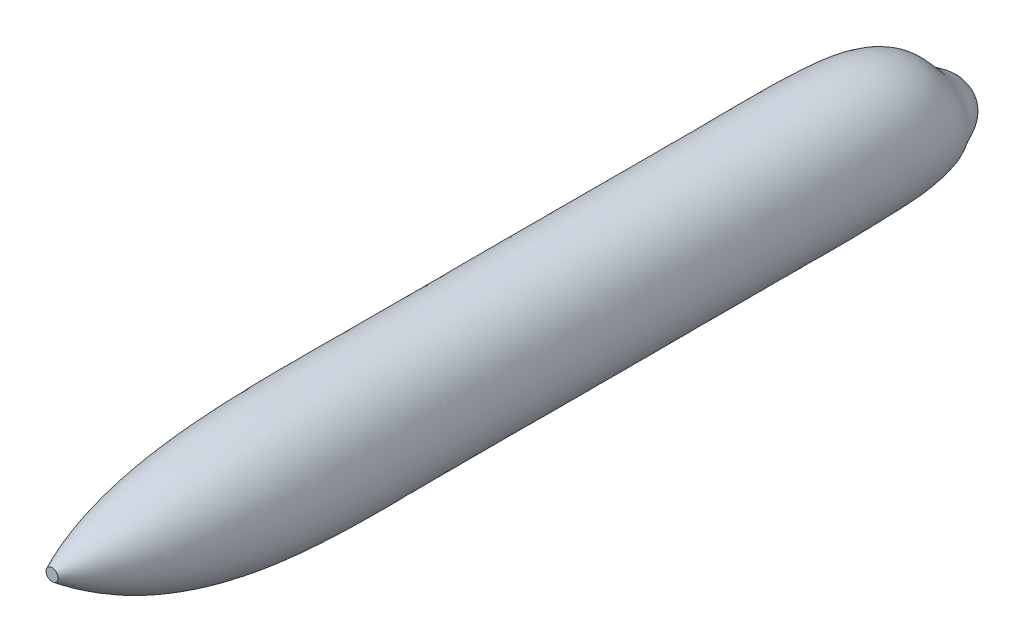
ISO-10303-21;
HEADER;
FILE_DESCRIPTION(('STEP AP214'),'2;1');
FILE_NAME('part.step','',(''),(''),'','','');
FILE_SCHEMA(('AUTOMOTIVE_DESIGN { 1 0 10303 214 1 1 1 1 }'));
ENDSEC;
DATA;
#1=APPLICATION_CONTEXT('core data for automotive mechanical design processes');
#2=APPLICATION_PROTOCOL_DEFINITION('international standard','automotive_design',2000,#1);
#3=PRODUCT_CONTEXT('',#1,'mechanical');
#4=PRODUCT('Part','Part','',(#3));
#5=PRODUCT_RELATED_PRODUCT_CATEGORY('part','',(#4));
#6=PRODUCT_DEFINITION_FORMATION('','',#4);
#7=PRODUCT_DEFINITION_CONTEXT('part definition',#1,'design');
#8=PRODUCT_DEFINITION('design','',#6,#7);
#9=PRODUCT_DEFINITION_SHAPE('','',#8);
#10=(LENGTH_UNIT() NAMED_UNIT(*) SI_UNIT(.MILLI.,.METRE.));
#11=(NAMED_UNIT(*) PLANE_ANGLE_UNIT() SI_UNIT($,.RADIAN.));
#12=(NAMED_UNIT(*) SI_UNIT($,.STERADIAN.) SOLID_ANGLE_UNIT());
#13=UNCERTAINTY_MEASURE_WITH_UNIT(LENGTH_MEASURE(1.E-05),#10,'distance_accuracy_value','');
#14=(GEOMETRIC_REPRESENTATION_CONTEXT(3) GLOBAL_UNCERTAINTY_ASSIGNED_CONTEXT((#13)) GLOBAL_UNIT_ASSIGNED_CONTEXT((#10,
#11,#12)) REPRESENTATION_CONTEXT('',''));
#15=CARTESIAN_POINT('',(0.,0.,0.));
#16=DIRECTION('',(0.,0.,1.));
#17=DIRECTION('',(1.,0.,0.));
#18=AXIS2_PLACEMENT_3D('',#15,#16,#17);
#19=CARTESIAN_POINT('',(0.2,0.738404320159,30.));
#20=DIRECTION('',(0.,0.,1.));
#21=DIRECTION('',(0.,-1.,0.));
#22=AXIS2_PLACEMENT_3D('',#19,#20,#21);
#23=PLANE('',#22);
#24=CARTESIAN_POINT('',(0.2,0.738404320159,30.));
#25=CARTESIAN_POINT('',(0.199999083958737,0.727555067152027,29.9999999999998));
#26=CARTESIAN_POINT('',(0.199118813986319,0.716695662450988,30.));
#27=CARTESIAN_POINT('',(0.1937798392259,0.684275475773811,30.0000000000003));
#28=CARTESIAN_POINT('',(0.186585399013803,0.663107478448318,30.));
#29=CARTESIAN_POINT('',(0.165504600757467,0.62387775512687,29.9999999999998));
#30=CARTESIAN_POINT('',(0.151481238370933,0.605890375158264,29.9999999999999));
#31=CARTESIAN_POINT('',(0.118268944908271,0.575562763302453,30.));
#32=CARTESIAN_POINT('',(0.0990800461539387,0.563222496081437,30.));
#33=CARTESIAN_POINT('',(0.0576998220440303,0.545591520505042,30.));
#34=CARTESIAN_POINT('',(0.0355084903566855,0.54030082701662,30.0000000000001));
#35=CARTESIAN_POINT('',(-0.00937471853272238,0.537362481108111,30.0000000000001));
#36=CARTESIAN_POINT('',(-0.0320665975259966,0.539714856043192,30.0000000000001));
#37=CARTESIAN_POINT('',(-0.0753924094626665,0.55179832695089,30.0000000000001));
#38=CARTESIAN_POINT('',(-0.0960263488351213,0.561529399871437,30.0000000000001));
#39=CARTESIAN_POINT('',(-0.132910001814,0.587272877587436,30.0000000000001));
#40=CARTESIAN_POINT('',(-0.149159722805382,0.603285271802259,30.0000000000001));
#41=CARTESIAN_POINT('',(-0.175443007080195,0.639786211471755,30.0000000000002));
#42=CARTESIAN_POINT('',(-0.185476556557258,0.660274766868025,30.0000000000002));
#43=CARTESIAN_POINT('',(-0.198196230467701,0.703418088594473,30.0000000000002));
#44=CARTESIAN_POINT('',(-0.200882349775954,0.72607285643566,30.0000000000002));
#45=CARTESIAN_POINT('',(-0.19860430067622,0.770994398274741,30.0000000000002));
#46=CARTESIAN_POINT('',(-0.193640143203083,0.793261172827165,30.0000000000003));
#47=CARTESIAN_POINT('',(-0.17662124353201,0.834896372093858,30.0000000000003));
#48=CARTESIAN_POINT('',(-0.164566498995468,0.854264795852196,30.0000000000002));
#49=CARTESIAN_POINT('',(-0.134725481861552,0.887919634485189,30.0000000000002));
#50=CARTESIAN_POINT('',(-0.116939202062283,0.902206042974049,30.0000000000002));
#51=CARTESIAN_POINT('',(-0.0776404056350319,0.924086232042898,30.0000000000002));
#52=CARTESIAN_POINT('',(-0.0561278945569783,0.931680022590914,30.0000000000002));
#53=CARTESIAN_POINT('',(-0.0118020466646883,0.939318338569548,30.0000000000002));
#54=CARTESIAN_POINT('',(0.0110112879735947,0.939362876627813,30.0000000000002));
#55=CARTESIAN_POINT('',(0.0553668860854771,0.931899685825513,30.0000000000002));
#56=CARTESIAN_POINT('',(0.0769091459796506,0.924391935698306,30.0000000000002));
#57=CARTESIAN_POINT('',(0.116293767771191,0.902663223469563,30.0000000000001));
#58=CARTESIAN_POINT('',(0.134136122598593,0.88844224854023,30.0000000000001));
#59=CARTESIAN_POINT('',(0.164109448531581,0.854917731437337,30.0000000000001));
#60=CARTESIAN_POINT('',(0.176240447608833,0.835614214156518,30.0000000000001));
#61=CARTESIAN_POINT('',(0.193422514860727,0.793999126241417,30.0000000000005));
#62=CARTESIAN_POINT('',(0.198473576022344,0.771687552627531,30.0000000000008));
#63=CARTESIAN_POINT('',(0.199901647054356,0.745682558299765,30.0000000000002));
#64=CARTESIAN_POINT('',(0.200000307312082,0.742044010494522,30.0000000000001));
#65=CARTESIAN_POINT('',(0.2,0.738404320159,30.));
#66=B_SPLINE_CURVE_WITH_KNOTS('',3,(#24,#25,#26,#27,#28,#29,#30,#31,#32,#33,#34,#35,#36,#37,#38,
#39,#40,#41,#42,#43,#44,#45,#46,#47,#48,#49,#50,#51,#52,#53,#54,#55,#56,#57,#58,#59,#60,#61,#62,
#63,#64,#65),.UNSPECIFIED.,.T.,.F.,(4,2,2,2,2,2,2,2,2,2,2,2,2,2,2,2,2,2,2,2,4),(0.,
0.0325486357339271,0.0983254626161641,0.16547996737244,0.232634051939303,0.29978827812824,
0.366942744667918,0.434097001408649,0.501251145031268,0.568405437805431,0.635559777422412,
0.702714021053079,0.76986828683246,0.837022636994092,0.904176887135468,0.971331024947824,
1.03848535186141,1.10563980709567,1.17279393343401,1.23994812629175,1.25086749141661),.UNSPECIFIED.);
#67=CARTESIAN_POINT('',(0.2,0.738404320159,30.));
#68=VERTEX_POINT('',#67);
#69=EDGE_CURVE('E11',#68,#68,#66,.T.);
#70=ORIENTED_EDGE('',*,*,#69,.F.);
#71=EDGE_LOOP('',(#70));
#72=FACE_BOUND('',#71,.T.);
#73=ADVANCED_FACE('F17',(#72),#23,.T.);
#74=CARTESIAN_POINT('',(0.,-0.60688,0.));
#75=CARTESIAN_POINT('',(0.157010416085,-0.6334641865,-0.01882457460849));
#76=CARTESIAN_POINT('',(0.447031615661,-0.617311786076,0.124805782578));
#77=CARTESIAN_POINT('',(0.71266974977,-0.597116345933,0.331911798499));
#78=CARTESIAN_POINT('',(0.969673085337,-0.566483770089,0.693944325814));
#79=CARTESIAN_POINT('',(1.062259403692,-0.563445380986,0.956441086316));
#80=CARTESIAN_POINT('',(1.427744798278,-0.323887828887,1.40719175944));
#81=CARTESIAN_POINT('',(1.667059312405,-0.168282492741,1.848299911504));
#82=CARTESIAN_POINT('',(1.896097995236,-0.06026270948949,2.698002161296));
#83=CARTESIAN_POINT('',(1.965765505251,-0.004997530077309,3.69052525364));
#84=CARTESIAN_POINT('',(2.011227967564,0.004476820403451,5.076433130514));
#85=CARTESIAN_POINT('',(1.99553328435,-0.003044735186701,7.483512209233));
#86=CARTESIAN_POINT('',(2.000172154538,0.002487719853474,10.891557756513));
#87=CARTESIAN_POINT('',(2.003359318858,-0.00271768887715,14.951749252542));
#88=CARTESIAN_POINT('',(1.982568434077,0.009285740104741,21.424264260111));
#89=CARTESIAN_POINT('',(2.105514375441,-0.04717865236319,26.624245677452));
#90=CARTESIAN_POINT('',(0.2,0.738404320159,30.));
#91=CARTESIAN_POINT('',(0.,-0.60688,0.));
#92=CARTESIAN_POINT('',(0.157010416085,-0.557577606544,-0.01882457460848));
#93=CARTESIAN_POINT('',(0.447031615661,-0.401251595356,0.124805782578));
#94=CARTESIAN_POINT('',(0.71266974977,-0.252667415115,0.331911798499));
#95=CARTESIAN_POINT('',(0.969673085337,-0.09781948681587,0.693944325814));
#96=CARTESIAN_POINT('',(1.062259403692,-0.0500320980869,0.956441086316));
#97=CARTESIAN_POINT('',(1.427744798278,0.366172566416,1.40719175944));
#98=CARTESIAN_POINT('',(1.667059312405,0.637443859405,1.848299911504));
#99=CARTESIAN_POINT('',(1.896097995236,0.856163064713,2.698002161296));
#100=CARTESIAN_POINT('',(1.96576550525,0.945100080688,3.690525253639));
#101=CARTESIAN_POINT('',(2.011227967565,0.976547436956,5.076433130514));
#102=CARTESIAN_POINT('',(1.99553328435,0.961440296522,7.483512209232));
#103=CARTESIAN_POINT('',(2.000172154538,0.969214819332,10.891557756513));
#104=CARTESIAN_POINT('',(2.003359318858,0.965549837065,14.951749252541));
#105=CARTESIAN_POINT('',(1.982568434077,0.967504575141,21.42426426011));
#106=CARTESIAN_POINT('',(2.105514375441,0.970462654392,26.624245677451));
#107=CARTESIAN_POINT('',(0.2,0.8350687095,30.000000000003));
#108=CARTESIAN_POINT('',(0.,-0.60688,0.));
#109=CARTESIAN_POINT('',(0.117276077704,-0.481695730902,-0.01882457460851));
#110=CARTESIAN_POINT('',(0.333902143574,-0.185193502082,0.124805782578));
#111=CARTESIAN_POINT('',(0.532315721688,0.09178243505225,0.331911798499));
#112=CARTESIAN_POINT('',(0.724279693911,0.370844515414,0.693944325814));
#113=CARTESIAN_POINT('',(0.793435362282,0.463381611589,0.956441086316));
#114=CARTESIAN_POINT('',(1.066428037569,1.056233130643,1.40719175944));
#115=CARTESIAN_POINT('',(1.245179665991,1.443170595421,1.848299911505));
#116=CARTESIAN_POINT('',(1.416255948916,1.772589170511,2.698002161295));
#117=CARTESIAN_POINT('',(1.468292829794,1.895198086738,3.690525253642));
#118=CARTESIAN_POINT('',(1.502250190047,1.948618432689,5.076433130514));
#119=CARTESIAN_POINT('',(1.490527331565,1.925925720913,7.483512209237));
#120=CARTESIAN_POINT('',(1.493992251372,1.935942299432,10.891557756511));
#121=CARTESIAN_POINT('',(1.496372845857,1.933817756905,14.951749252548));
#122=CARTESIAN_POINT('',(1.480843472201,1.92572377017,21.424264260116));
#123=CARTESIAN_POINT('',(1.572675709401,1.988104486731,26.62424567746));
#124=CARTESIAN_POINT('',(0.149386366367,0.931731273317,29.999999999991));
#125=CARTESIAN_POINT('',(0.,-0.60688,0.));
#126=CARTESIAN_POINT('',(0.03780976651207,-0.428470595392,-0.01882457460844));
#127=CARTESIAN_POINT('',(0.107649934528,-0.03373714580793,0.124805782578));
#128=CARTESIAN_POINT('',(0.17161840285,0.333206736441,0.331911798498));
#129=CARTESIAN_POINT('',(0.233507520482,0.699342682278,0.693944325814));
#130=CARTESIAN_POINT('',(0.255803283825,0.823240014902,0.956441086315));
#131=CARTESIAN_POINT('',(0.34381602704,1.53990890231,1.40719175944));
#132=CARTESIAN_POINT('',(0.401445489642,2.007917343826,1.848299911501));
#133=CARTESIAN_POINT('',(0.456600423544,2.414927725477,2.698002161296));
#134=CARTESIAN_POINT('',(0.473377095766,2.561137429701,3.690525253632));
#135=CARTESIAN_POINT('',(0.484324936863,2.62995921013,5.076433130515));
#136=CARTESIAN_POINT('',(0.480545491376,2.6019495118,7.483512209223));
#137=CARTESIAN_POINT('',(0.481662580315,2.61353768912,10.891557756517));
#138=CARTESIAN_POINT('',(0.482430083144,2.61249276406,14.951749252525));
#139=CARTESIAN_POINT('',(0.4774234185,2.597355700825,21.424264260098));
#140=CARTESIAN_POINT('',(0.507030099714,2.701385584122,26.624245677432));
#141=CARTESIAN_POINT('',(0.04816211236818,0.999498736865,30.000000000018));
#142=CARTESIAN_POINT('',(0.,-0.60688,0.));
#143=CARTESIAN_POINT('',(-0.06714097939534,-0.42079738177,-0.01882457460855));
#144=CARTESIAN_POINT('',(-0.191160186979,-0.01158759936085,0.124805782578));
#145=CARTESIAN_POINT('',(-0.304752679335,0.368632403499,0.331911798499));
#146=CARTESIAN_POINT('',(-0.414652748949,0.747502510505,0.693944325814));
#147=CARTESIAN_POINT('',(-0.454244619656,0.876017930904,0.956441086318));
#148=CARTESIAN_POINT('',(-0.610533915354,1.61083496072,1.407191759441));
#149=CARTESIAN_POINT('',(-0.71286987027,2.090736828383,1.848299911509));
#150=CARTESIAN_POINT('',(-0.810811662096,2.509123033982,2.698002161294));
#151=CARTESIAN_POINT('',(-0.84060296492,2.658795096289,3.690525253654));
#152=CARTESIAN_POINT('',(-0.86004367671,2.729874738995,5.076433130513));
#153=CARTESIAN_POINT('',(-0.853332297746,2.701085787799,7.483512209253));
#154=CARTESIAN_POINT('',(-0.855315976894,2.712904072233,10.891557756503));
#155=CARTESIAN_POINT('',(-0.856678875859,2.712017821608,14.951749252576));
#156=CARTESIAN_POINT('',(-0.847788253179,2.695847087058,21.424264260136));
#157=CARTESIAN_POINT('',(-0.900362541695,2.805988602686,26.624245677493));
#158=CARTESIAN_POINT('',(-0.08552423599638,1.009384569122,29.999999999977));
#159=CARTESIAN_POINT('',(0.,-0.60688,0.));
#160=CARTESIAN_POINT('',(-0.16900934718,-0.47084486747,-0.01882457460843));
#161=CARTESIAN_POINT('',(-0.481194327199,-0.154780734574,0.124805782578));
#162=CARTESIAN_POINT('',(-0.76713285759,0.14008567139,0.331911798498));
#163=CARTESIAN_POINT('',(-1.043776707408,0.436632150167,0.693944325814));
#164=CARTESIAN_POINT('',(-1.143438587253,0.535419484514,0.956441086312));
#165=CARTESIAN_POINT('',(-1.536854829837,1.15307389398,1.40719175944));
#166=CARTESIAN_POINT('',(-1.794458056504,1.556235581071,1.848299911497));
#167=CARTESIAN_POINT('',(-2.041000160055,1.901192723389,2.698002161297));
#168=CARTESIAN_POINT('',(-2.115991747774,2.028524670308,3.690525253619));
#169=CARTESIAN_POINT('',(-2.164928507932,2.08502954944,5.076433130517));
#170=CARTESIAN_POINT('',(-2.148034417538,2.061271647791,7.483512209206));
#171=CARTESIAN_POINT('',(-2.153027795943,2.071603407743,10.891557756531));
#172=CARTESIAN_POINT('',(-2.156458527325,2.069694494043,14.951749252491));
#173=CARTESIAN_POINT('',(-2.134078777291,2.060191647228,21.424264260078));
#174=CARTESIAN_POINT('',(-2.266420400269,2.130905079875,26.624245677392));
#175=CARTESIAN_POINT('',(-0.215284248515,0.945375605163,30.000000000019));
#176=CARTESIAN_POINT('',(0.,-0.60688,0.));
#177=CARTESIAN_POINT('',(-0.232956351145,-0.572593822974,-0.0188245746085));
#178=CARTESIAN_POINT('',(-0.663260799046,-0.443344118902,0.124805782578));
#179=CARTESIAN_POINT('',(-1.05738809321,-0.319523046505,0.3319117985));
#180=CARTESIAN_POINT('',(-1.43870393695,-0.188874248657,0.693944325814));
#181=CARTESIAN_POINT('',(-1.57607425561,-0.149737972735,0.95644108632));
#182=CARTESIAN_POINT('',(-2.118344928105,0.232137798866,1.40719175944));
#183=CARTESIAN_POINT('',(-2.473415867835,0.480953483976,1.848299911511));
#184=CARTESIAN_POINT('',(-2.813240556904,0.678166201448,2.698002161293));
#185=CARTESIAN_POINT('',(-2.916606240066,0.760566168586,3.690525253663));
#186=CARTESIAN_POINT('',(-2.984058894494,0.787744313076,5.07643313051));
#187=CARTESIAN_POINT('',(-2.960772693312,0.774111466994,7.483512209262));
#188=CARTESIAN_POINT('',(-2.967655384925,0.781449761247,10.891557756485));
#189=CARTESIAN_POINT('',(-2.972384180558,0.777486326807,14.9517492526));
#190=CARTESIAN_POINT('',(-2.941536745236,0.781391045782,21.424264260143));
#191=CARTESIAN_POINT('',(-3.123951635924,0.772815960938,26.624245677519));
#192=CARTESIAN_POINT('',(-0.296739995924,0.816184800161,29.999999999995));
#193=CARTESIAN_POINT('',(0.,-0.60688,0.));
#194=CARTESIAN_POINT('',(-0.232956351146,-0.694334550025,-0.01882457460854));
#195=CARTESIAN_POINT('',(-0.663260799046,-0.79127945325,0.124805782578));
#196=CARTESIAN_POINT('',(-1.057388093207,-0.874709645361,0.331911798498));
#197=CARTESIAN_POINT('',(-1.438703936951,-0.944093291522,0.693944325815));
#198=CARTESIAN_POINT('',(-1.576074255603,-0.977152789238,0.956441086312));
#199=CARTESIAN_POINT('',(-2.118344928104,-0.879913456641,1.407191759441));
#200=CARTESIAN_POINT('',(-2.473415867842,-0.817518469458,1.848299911498));
#201=CARTESIAN_POINT('',(-2.813240556867,-0.798691620427,2.698002161299));
#202=CARTESIAN_POINT('',(-2.916606240083,-0.770561228741,3.690525253619));
#203=CARTESIAN_POINT('',(-2.984058894471,-0.778790672269,5.076433130521));
#204=CARTESIAN_POINT('',(-2.960772693322,-0.780200937367,7.48351220921));
#205=CARTESIAN_POINT('',(-2.967655384917,-0.77647432154,10.891557756547));
#206=CARTESIAN_POINT('',(-2.972384180559,-0.782921704561,14.951749252492));
#207=CARTESIAN_POINT('',(-2.941536745229,-0.762819565573,21.424264260089));
#208=CARTESIAN_POINT('',(-3.123951635931,-0.867173265664,26.6242456774));
#209=CARTESIAN_POINT('',(-0.296739995924,0.660623840156,29.999999999991));
#210=CARTESIAN_POINT('',(0.,-0.60688,0.));
#211=CARTESIAN_POINT('',(-0.169009347179,-0.796083505531,-0.0188245746084));
#212=CARTESIAN_POINT('',(-0.481194327199,-1.079842837578,0.124805782578));
#213=CARTESIAN_POINT('',(-0.767132857592,-1.334318363254,0.331911798499));
#214=CARTESIAN_POINT('',(-1.043776707407,-1.569599690346,0.693944325813));
#215=CARTESIAN_POINT('',(-1.143438587258,-1.662310246485,0.956441086318));
#216=CARTESIAN_POINT('',(-1.536854829839,-1.800849551754,1.407191759439));
#217=CARTESIAN_POINT('',(-1.794458056498,-1.892800566554,1.848299911507));
#218=CARTESIAN_POINT('',(-2.041000160085,-2.021718142368,2.698002161292));
#219=CARTESIAN_POINT('',(-2.115991747761,-2.038519730463,3.690525253654));
#220=CARTESIAN_POINT('',(-2.164928507951,-2.076075908632,5.076433130508));
#221=CARTESIAN_POINT('',(-2.14803441753,-2.067361118164,7.483512209247));
#222=CARTESIAN_POINT('',(-2.153027795949,-2.066627968036,10.891557756481));
#223=CARTESIAN_POINT('',(-2.156458527324,-2.075129871797,14.951749252576));
#224=CARTESIAN_POINT('',(-2.134078777297,-2.041620167018,21.424264260122));
#225=CARTESIAN_POINT('',(-2.266420400262,-2.225262384601,26.624245677483));
#226=CARTESIAN_POINT('',(-0.215284248515,0.531433035156,30.000000000018));
#227=CARTESIAN_POINT('',(0.,-0.60688,0.));
#228=CARTESIAN_POINT('',(-0.06714097939559,-0.846130991228,-0.01882457460856));
#229=CARTESIAN_POINT('',(-0.191160186979,-1.223035972792,0.124805782578));
#230=CARTESIAN_POINT('',(-0.304752679334,-1.562865095365,0.331911798498));
#231=CARTESIAN_POINT('',(-0.41465274895,-1.880470050684,0.693944325815));
#232=CARTESIAN_POINT('',(-0.454244619653,-2.002908692877,0.956441086315));
#233=CARTESIAN_POINT('',(-0.610533915353,-2.258610618495,1.407191759441));
#234=CARTESIAN_POINT('',(-0.712869870274,-2.427301813866,1.848299911502));
#235=CARTESIAN_POINT('',(-0.810811662076,-2.629648452962,2.698002161298));
#236=CARTESIAN_POINT('',(-0.840602964929,-2.668790156445,3.690525253632));
#237=CARTESIAN_POINT('',(-0.860043676698,-2.720921098189,5.076433130519));
#238=CARTESIAN_POINT('',(-0.853332297751,-2.707175258173,7.483512209228));
#239=CARTESIAN_POINT('',(-0.85531597689,-2.707928632527,10.891557756536));
#240=CARTESIAN_POINT('',(-0.85667887586,-2.717453199363,14.951749252524));
#241=CARTESIAN_POINT('',(-0.847788253175,-2.67727560685,21.424264260108));
#242=CARTESIAN_POINT('',(-0.900362541699,-2.900345907414,26.624245677441));
#243=CARTESIAN_POINT('',(-0.08552423599638,0.467424071195,29.999999999982));
#244=CARTESIAN_POINT('',(0.,-0.60688,0.));
#245=CARTESIAN_POINT('',(0.03780976651219,-0.838457777608,-0.01882457460845));
#246=CARTESIAN_POINT('',(0.107649934528,-1.200886426345,0.124805782578));
#247=CARTESIAN_POINT('',(0.171618402849,-1.527439428306,0.331911798499));
#248=CARTESIAN_POINT('',(0.233507520483,-1.832310222456,0.693944325814));
#249=CARTESIAN_POINT('',(0.255803283824,-1.950130776874,0.956441086316));
#250=CARTESIAN_POINT('',(0.343816027039,-2.187684560085,1.407191759439));
#251=CARTESIAN_POINT('',(0.401445489644,-2.344482329309,1.848299911504));
#252=CARTESIAN_POINT('',(0.456600423534,-2.535453144455,2.698002161294));
#253=CARTESIAN_POINT('',(0.47337709577,-2.571132489855,3.690525253643));
#254=CARTESIAN_POINT('',(0.484324936857,-2.621005569322,5.076433130512));
#255=CARTESIAN_POINT('',(0.480545491379,-2.608038982173,7.483512209235));
#256=CARTESIAN_POINT('',(0.481662580313,-2.608562249412,10.8915577565));
#257=CARTESIAN_POINT('',(0.482430083145,-2.617928141814,14.951749252549));
#258=CARTESIAN_POINT('',(0.477423418498,-2.578784220614,21.424264260111));
#259=CARTESIAN_POINT('',(0.507030099716,-2.795742888848,26.624245677455));
#260=CARTESIAN_POINT('',(0.04816211236818,0.477309903453,30.000000000012));
#261=CARTESIAN_POINT('',(0.,-0.60688,0.));
#262=CARTESIAN_POINT('',(0.117276077704,-0.785232642097,-0.0188245746085));
#263=CARTESIAN_POINT('',(0.333902143574,-1.04943007007,0.124805782578));
#264=CARTESIAN_POINT('',(0.532315721689,-1.286015126918,0.331911798499));
#265=CARTESIAN_POINT('',(0.724279693911,-1.503812055593,0.693944325814));
#266=CARTESIAN_POINT('',(0.793435362283,-1.590272373561,0.956441086316));
#267=CARTESIAN_POINT('',(1.066428037569,-1.704008788418,1.40719175944));
#268=CARTESIAN_POINT('',(1.24517966599,-1.779735580904,1.848299911504));
#269=CARTESIAN_POINT('',(1.41625594892,-1.89311458949,2.698002161296));
#270=CARTESIAN_POINT('',(1.468292829792,-1.905193146892,3.690525253638));
#271=CARTESIAN_POINT('',(1.502250190049,-1.939664791882,5.076433130515));
#272=CARTESIAN_POINT('',(1.490527331564,-1.932015191287,7.483512209233));
#273=CARTESIAN_POINT('',(1.493992251373,-1.930966859726,10.891557756518));
#274=CARTESIAN_POINT('',(1.496372845856,-1.939253134659,14.95174925254));
#275=CARTESIAN_POINT('',(1.480843472202,-1.907152289961,21.424264260112));
#276=CARTESIAN_POINT('',(1.5726757094,-2.082461791458,26.624245677452));
#277=CARTESIAN_POINT('',(0.149386366367,0.545077367001,29.999999999995));
#278=CARTESIAN_POINT('',(0.,-0.60688,0.));
#279=CARTESIAN_POINT('',(0.157010416085,-0.709350766455,-0.01882457460848));
#280=CARTESIAN_POINT('',(0.447031615661,-0.833371976797,0.124805782578));
#281=CARTESIAN_POINT('',(0.71266974977,-0.94156527675,0.331911798499));
#282=CARTESIAN_POINT('',(0.969673085337,-1.035148053363,0.693944325814));
#283=CARTESIAN_POINT('',(1.062259403692,-1.076858663885,0.956441086316));
#284=CARTESIAN_POINT('',(1.427744798278,-1.01394822419,1.40719175944));
#285=CARTESIAN_POINT('',(1.667059312405,-0.974008844888,1.848299911504));
#286=CARTESIAN_POINT('',(1.896097995235,-0.976688483692,2.698002161295));
#287=CARTESIAN_POINT('',(1.965765505251,-0.955095140842,3.69052525364));
#288=CARTESIAN_POINT('',(2.011227967564,-0.967593796149,5.076433130514));
#289=CARTESIAN_POINT('',(1.99553328435,-0.967529766895,7.483512209233));
#290=CARTESIAN_POINT('',(2.000172154538,-0.964239379625,10.891557756512));
#291=CARTESIAN_POINT('',(2.003359318859,-0.970985214819,14.951749252542));
#292=CARTESIAN_POINT('',(1.982568434077,-0.948933094931,21.424264260111));
#293=CARTESIAN_POINT('',(2.105514375441,-1.064819959119,26.624245677452));
#294=CARTESIAN_POINT('',(0.2,0.641739930818,30.000000000001));
#295=CARTESIAN_POINT('',(0.,-0.60688,0.));
#296=CARTESIAN_POINT('',(0.157010416085,-0.6334641865,-0.01882457460849));
#297=CARTESIAN_POINT('',(0.447031615661,-0.617311786076,0.124805782578));
#298=CARTESIAN_POINT('',(0.71266974977,-0.597116345933,0.331911798499));
#299=CARTESIAN_POINT('',(0.969673085337,-0.566483770089,0.693944325814));
#300=CARTESIAN_POINT('',(1.062259403692,-0.563445380986,0.956441086316));
#301=CARTESIAN_POINT('',(1.427744798278,-0.323887828887,1.40719175944));
#302=CARTESIAN_POINT('',(1.667059312405,-0.168282492741,1.848299911504));
#303=CARTESIAN_POINT('',(1.896097995236,-0.06026270948949,2.698002161296));
#304=CARTESIAN_POINT('',(1.965765505251,-0.004997530077309,3.69052525364));
#305=CARTESIAN_POINT('',(2.011227967564,0.004476820403451,5.076433130514));
#306=CARTESIAN_POINT('',(1.99553328435,-0.003044735186701,7.483512209233));
#307=CARTESIAN_POINT('',(2.000172154538,0.002487719853474,10.891557756513));
#308=CARTESIAN_POINT('',(2.003359318858,-0.00271768887715,14.951749252542));
#309=CARTESIAN_POINT('',(1.982568434077,0.009285740104741,21.424264260111));
#310=CARTESIAN_POINT('',(2.105514375441,-0.04717865236319,26.624245677452));
#311=CARTESIAN_POINT('',(0.2,0.738404320159,30.));
#312=B_SPLINE_SURFACE_WITH_KNOTS('',13,3,((#74,#75,#76,#77,#78,#79,#80,#81,#82,#83,#84,#85,#86,
#87,#88,#89,#90),(#91,#92,#93,#94,#95,#96,#97,#98,#99,#100,#101,#102,#103,#104,#105,#106,#107),
(#108,#109,#110,#111,#112,#113,#114,#115,#116,#117,#118,#119,#120,#121,#122,#123,#124),(#125,
#126,#127,#128,#129,#130,#131,#132,#133,#134,#135,#136,#137,#138,#139,#140,#141),(#142,#143,
#144,#145,#146,#147,#148,#149,#150,#151,#152,#153,#154,#155,#156,#157,#158),(#159,#160,#161,
#162,#163,#164,#165,#166,#167,#168,#169,#170,#171,#172,#173,#174,#175),(#176,#177,#178,#179,
#180,#181,#182,#183,#184,#185,#186,#187,#188,#189,#190,#191,#192),(#193,#194,#195,#196,#197,
#198,#199,#200,#201,#202,#203,#204,#205,#206,#207,#208,#209),(#210,#211,#212,#213,#214,#215,
#216,#217,#218,#219,#220,#221,#222,#223,#224,#225,#226),(#227,#228,#229,#230,#231,#232,#233,
#234,#235,#236,#237,#238,#239,#240,#241,#242,#243),(#244,#245,#246,#247,#248,#249,#250,#251,
#252,#253,#254,#255,#256,#257,#258,#259,#260),(#261,#262,#263,#264,#265,#266,#267,#268,#269,
#270,#271,#272,#273,#274,#275,#276,#277),(#278,#279,#280,#281,#282,#283,#284,#285,#286,#287,
#288,#289,#290,#291,#292,#293,#294),(#295,#296,#297,#298,#299,#300,#301,#302,#303,#304,#305,
#306,#307,#308,#309,#310,#311)),.UNSPECIFIED.,.T.,.F.,.F.,(14,14),(4,1,1,1,1,1,1,1,1,1,1,1,1,1,
4),(0.,1.),(0.,0.021402542321,0.03206421418585,0.04409714726472,0.05876299847175,
0.07505692119453,0.09312102873842,0.121270452593,0.156504706407,0.18703714999,0.255195133902,
0.383569000666,0.511942867429,0.640316734192,1.),.UNSPECIFIED.);
#313=ORIENTED_EDGE('',*,*,#69,.T.);
#314=EDGE_LOOP('',(#313));
#315=FACE_BOUND('',#314,.T.);
#316=CARTESIAN_POINT('',(0.,-0.60688,0.));
#317=VERTEX_POINT('',#316);
#318=VERTEX_LOOP('',#317);
#319=FACE_BOUND('',#318,.T.);
#320=ADVANCED_FACE('F19',(#315,#319),#312,.T.);
#321=CLOSED_SHELL('',(#73,#320));
#322=MANIFOLD_SOLID_BREP('B1',#321);
#323=ADVANCED_BREP_SHAPE_REPRESENTATION('',(#18,#322),#14);
#324=SHAPE_DEFINITION_REPRESENTATION(#9,#323);
ENDSEC;
END-ISO-10303-21;
